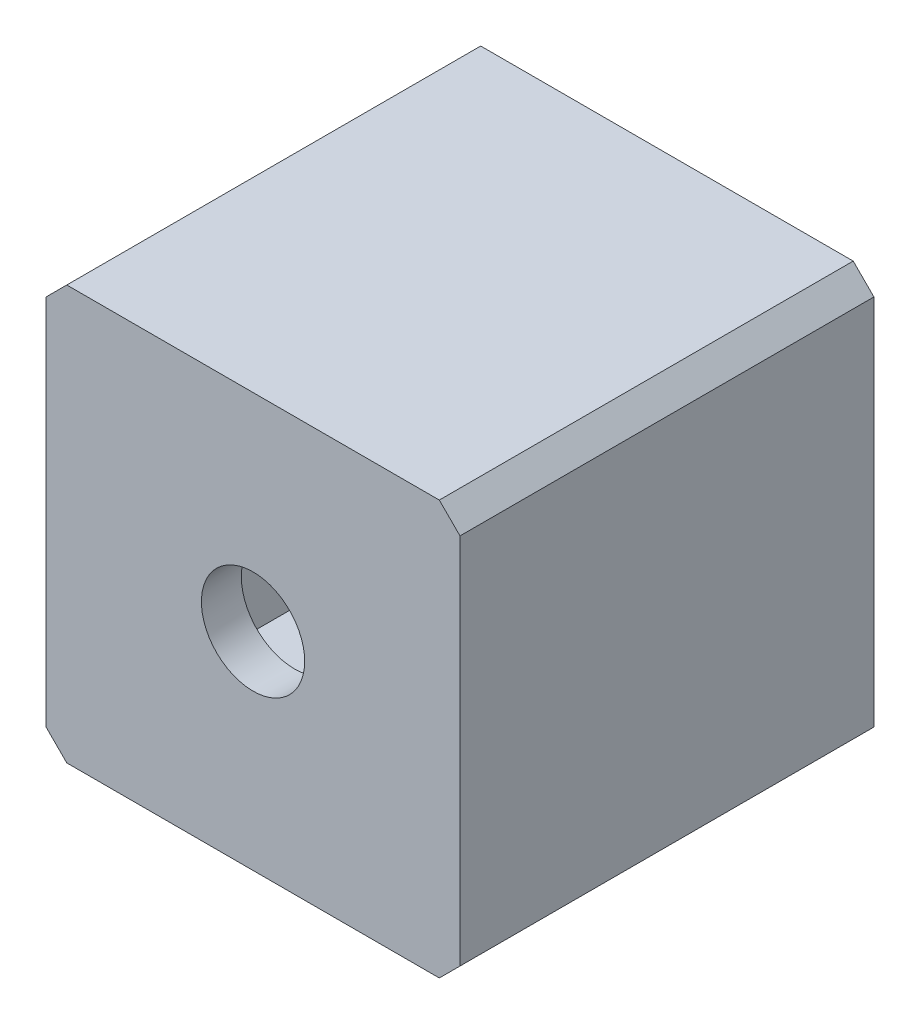
ISO-10303-21;
HEADER;
FILE_DESCRIPTION(('STEP AP214'),'2;1');
FILE_NAME('part.step','',(''),(''),'','','');
FILE_SCHEMA(('AUTOMOTIVE_DESIGN { 1 0 10303 214 1 1 1 1 }'));
ENDSEC;
DATA;
#1=APPLICATION_CONTEXT('core data for automotive mechanical design processes');
#2=APPLICATION_PROTOCOL_DEFINITION('international standard','automotive_design',2000,#1);
#3=PRODUCT_CONTEXT('',#1,'mechanical');
#4=PRODUCT('Part','Part','',(#3));
#5=PRODUCT_RELATED_PRODUCT_CATEGORY('part','',(#4));
#6=PRODUCT_DEFINITION_FORMATION('','',#4);
#7=PRODUCT_DEFINITION_CONTEXT('part definition',#1,'design');
#8=PRODUCT_DEFINITION('design','',#6,#7);
#9=PRODUCT_DEFINITION_SHAPE('','',#8);
#10=(LENGTH_UNIT() NAMED_UNIT(*) SI_UNIT(.MILLI.,.METRE.));
#11=(NAMED_UNIT(*) PLANE_ANGLE_UNIT() SI_UNIT($,.RADIAN.));
#12=(NAMED_UNIT(*) SI_UNIT($,.STERADIAN.) SOLID_ANGLE_UNIT());
#13=UNCERTAINTY_MEASURE_WITH_UNIT(LENGTH_MEASURE(1.E-05),#10,'distance_accuracy_value','');
#14=(GEOMETRIC_REPRESENTATION_CONTEXT(3) GLOBAL_UNCERTAINTY_ASSIGNED_CONTEXT((#13)) GLOBAL_UNIT_ASSIGNED_CONTEXT((#10,
#11,#12)) REPRESENTATION_CONTEXT('',''));
#15=CARTESIAN_POINT('',(0.,0.,0.));
#16=DIRECTION('',(0.,0.,1.));
#17=DIRECTION('',(1.,0.,0.));
#18=AXIS2_PLACEMENT_3D('',#15,#16,#17);
#19=CARTESIAN_POINT('',(-24.6304102547524,19.1826555023924,17.));
#20=DIRECTION('',(0.,0.,-1.));
#21=DIRECTION('',(1.,0.,0.));
#22=AXIS2_PLACEMENT_3D('',#19,#20,#21);
#23=CONICAL_SURFACE('',#22,2.6,0.0349065850398866);
#24=CARTESIAN_POINT('',(-24.6304102547524,19.1826555023924,20.));
#25=DIRECTION('',(0.,0.,1.));
#26=DIRECTION('',(1.,0.,0.));
#27=AXIS2_PLACEMENT_3D('',#24,#25,#26);
#28=CIRCLE('',#27,2.49523769152476);
#29=CARTESIAN_POINT('',(-22.1351725632276,19.1826555023924,20.));
#30=VERTEX_POINT('',#29);
#31=EDGE_CURVE('E170',#30,#30,#28,.T.);
#32=ORIENTED_EDGE('',*,*,#31,.T.);
#33=EDGE_LOOP('',(#32));
#34=FACE_BOUND('',#33,.T.);
#35=CARTESIAN_POINT('',(-24.6304102547524,19.1826555023924,18.));
#36=DIRECTION('',(0.,0.,-1.));
#37=DIRECTION('',(-1.,0.,0.));
#38=AXIS2_PLACEMENT_3D('',#35,#36,#37);
#39=CIRCLE('',#38,2.56507923050825);
#40=CARTESIAN_POINT('',(-27.1954894852606,19.1826555023924,18.));
#41=VERTEX_POINT('',#40);
#42=EDGE_CURVE('E166',#41,#41,#39,.T.);
#43=ORIENTED_EDGE('',*,*,#42,.T.);
#44=EDGE_LOOP('',(#43));
#45=FACE_BOUND('',#44,.T.);
#46=ADVANCED_FACE('F35',(#34,#45),#23,.F.);
#47=CARTESIAN_POINT('',(-34.6304102547524,29.1826555023924,20.));
#48=DIRECTION('',(1.,0.,0.));
#49=DIRECTION('',(0.,1.,0.));
#50=AXIS2_PLACEMENT_3D('',#47,#48,#49);
#51=PLANE('',#50);
#52=DIRECTION('',(0.,-1.,0.));
#53=VECTOR('',#52,1.);
#54=CARTESIAN_POINT('',(-34.6304102547524,29.1826555023924,20.));
#55=LINE('',#54,#53);
#56=CARTESIAN_POINT('',(-34.6304102547524,28.1826555023924,20.));
#57=VERTEX_POINT('',#56);
#58=CARTESIAN_POINT('',(-34.6304102547524,10.1826555023923,20.));
#59=VERTEX_POINT('',#58);
#60=EDGE_CURVE('E174',#57,#59,#55,.T.);
#61=ORIENTED_EDGE('',*,*,#60,.F.);
#62=DIRECTION('',(0.,0.,-1.));
#63=VECTOR('',#62,1.);
#64=CARTESIAN_POINT('',(-34.6304102547524,28.1826555023924,20.));
#65=LINE('',#64,#63);
#66=CARTESIAN_POINT('',(-34.6304102547524,28.1826555023924,0.));
#67=VERTEX_POINT('',#66);
#68=EDGE_CURVE('E11',#57,#67,#65,.T.);
#69=ORIENTED_EDGE('',*,*,#68,.T.);
#70=DIRECTION('',(0.,-1.,0.));
#71=VECTOR('',#70,1.);
#72=CARTESIAN_POINT('',(-34.6304102547524,29.1826555023924,0.));
#73=LINE('',#72,#71);
#74=CARTESIAN_POINT('',(-34.6304102547524,10.1826555023923,0.));
#75=VERTEX_POINT('',#74);
#76=EDGE_CURVE('E173',#67,#75,#73,.T.);
#77=ORIENTED_EDGE('',*,*,#76,.T.);
#78=DIRECTION('',(0.,0.,1.));
#79=VECTOR('',#78,1.);
#80=CARTESIAN_POINT('',(-34.6304102547524,10.1826555023923,20.));
#81=LINE('',#80,#79);
#82=EDGE_CURVE('E44',#75,#59,#81,.T.);
#83=ORIENTED_EDGE('',*,*,#82,.T.);
#84=EDGE_LOOP('',(#61,#69,#77,#83));
#85=FACE_BOUND('',#84,.T.);
#86=ADVANCED_FACE('F227',(#85),#51,.F.);
#87=CARTESIAN_POINT('',(-34.6304102547524,9.18265550239235,20.));
#88=DIRECTION('',(0.,1.,0.));
#89=DIRECTION('',(-1.,0.,0.));
#90=AXIS2_PLACEMENT_3D('',#87,#88,#89);
#91=PLANE('',#90);
#92=DIRECTION('',(1.,0.,0.));
#93=VECTOR('',#92,1.);
#94=CARTESIAN_POINT('',(-34.6304102547524,9.18265550239235,0.));
#95=LINE('',#94,#93);
#96=CARTESIAN_POINT('',(-33.6304102547524,9.18265550239235,0.));
#97=VERTEX_POINT('',#96);
#98=CARTESIAN_POINT('',(-15.6304102547524,9.18265550239235,0.));
#99=VERTEX_POINT('',#98);
#100=EDGE_CURVE('E188',#97,#99,#95,.T.);
#101=ORIENTED_EDGE('',*,*,#100,.T.);
#102=DIRECTION('',(0.,0.,1.));
#103=VECTOR('',#102,1.);
#104=CARTESIAN_POINT('',(-15.6304102547524,9.18265550239235,20.));
#105=LINE('',#104,#103);
#106=CARTESIAN_POINT('',(-15.6304102547524,9.18265550239235,20.));
#107=VERTEX_POINT('',#106);
#108=EDGE_CURVE('E212',#99,#107,#105,.T.);
#109=ORIENTED_EDGE('',*,*,#108,.T.);
#110=DIRECTION('',(1.,0.,0.));
#111=VECTOR('',#110,1.);
#112=CARTESIAN_POINT('',(-34.6304102547524,9.18265550239235,20.));
#113=LINE('',#112,#111);
#114=CARTESIAN_POINT('',(-33.6304102547524,9.18265550239235,20.));
#115=VERTEX_POINT('',#114);
#116=EDGE_CURVE('E177',#115,#107,#113,.T.);
#117=ORIENTED_EDGE('',*,*,#116,.F.);
#118=DIRECTION('',(0.,0.,-1.));
#119=VECTOR('',#118,1.);
#120=CARTESIAN_POINT('',(-33.6304102547524,9.18265550239235,20.));
#121=LINE('',#120,#119);
#122=EDGE_CURVE('E209',#115,#97,#121,.T.);
#123=ORIENTED_EDGE('',*,*,#122,.T.);
#124=EDGE_LOOP('',(#101,#109,#117,#123));
#125=FACE_BOUND('',#124,.T.);
#126=ADVANCED_FACE('F238',(#125),#91,.F.);
#127=CARTESIAN_POINT('',(-14.6304102547524,29.1826555023924,20.));
#128=DIRECTION('',(-1.,0.,0.));
#129=DIRECTION('',(0.,-1.,0.));
#130=AXIS2_PLACEMENT_3D('',#127,#128,#129);
#131=PLANE('',#130);
#132=DIRECTION('',(0.,1.,0.));
#133=VECTOR('',#132,1.);
#134=CARTESIAN_POINT('',(-14.6304102547524,29.1826555023924,20.));
#135=LINE('',#134,#133);
#136=CARTESIAN_POINT('',(-14.6304102547524,10.1826555023924,20.));
#137=VERTEX_POINT('',#136);
#138=CARTESIAN_POINT('',(-14.6304102547524,28.1826555023923,20.));
#139=VERTEX_POINT('',#138);
#140=EDGE_CURVE('E181',#137,#139,#135,.T.);
#141=ORIENTED_EDGE('',*,*,#140,.F.);
#142=DIRECTION('',(0.,0.,-1.));
#143=VECTOR('',#142,1.);
#144=CARTESIAN_POINT('',(-14.6304102547524,10.1826555023924,20.));
#145=LINE('',#144,#143);
#146=CARTESIAN_POINT('',(-14.6304102547524,10.1826555023924,0.));
#147=VERTEX_POINT('',#146);
#148=EDGE_CURVE('E198',#137,#147,#145,.T.);
#149=ORIENTED_EDGE('',*,*,#148,.T.);
#150=DIRECTION('',(0.,1.,0.));
#151=VECTOR('',#150,1.);
#152=CARTESIAN_POINT('',(-14.6304102547524,29.1826555023924,0.));
#153=LINE('',#152,#151);
#154=CARTESIAN_POINT('',(-14.6304102547524,28.1826555023923,0.));
#155=VERTEX_POINT('',#154);
#156=EDGE_CURVE('E191',#147,#155,#153,.T.);
#157=ORIENTED_EDGE('',*,*,#156,.T.);
#158=DIRECTION('',(0.,0.,1.));
#159=VECTOR('',#158,1.);
#160=CARTESIAN_POINT('',(-14.6304102547524,28.1826555023923,20.));
#161=LINE('',#160,#159);
#162=EDGE_CURVE('E185',#155,#139,#161,.T.);
#163=ORIENTED_EDGE('',*,*,#162,.T.);
#164=EDGE_LOOP('',(#141,#149,#157,#163));
#165=FACE_BOUND('',#164,.T.);
#166=ADVANCED_FACE('F249',(#165),#131,.F.);
#167=CARTESIAN_POINT('',(-34.6304102547524,29.1826555023924,20.));
#168=DIRECTION('',(0.,-1.,0.));
#169=DIRECTION('',(0.,0.,-1.));
#170=AXIS2_PLACEMENT_3D('',#167,#168,#169);
#171=PLANE('',#170);
#172=DIRECTION('',(-1.,0.,0.));
#173=VECTOR('',#172,1.);
#174=CARTESIAN_POINT('',(-34.6304102547524,29.1826555023924,20.));
#175=LINE('',#174,#173);
#176=CARTESIAN_POINT('',(-15.6304102547524,29.1826555023924,20.));
#177=VERTEX_POINT('',#176);
#178=CARTESIAN_POINT('',(-33.6304102547524,29.1826555023924,20.));
#179=VERTEX_POINT('',#178);
#180=EDGE_CURVE('E183',#177,#179,#175,.T.);
#181=ORIENTED_EDGE('',*,*,#180,.F.);
#182=DIRECTION('',(0.,0.,-1.));
#183=VECTOR('',#182,1.);
#184=CARTESIAN_POINT('',(-15.6304102547524,29.1826555023924,20.));
#185=LINE('',#184,#183);
#186=CARTESIAN_POINT('',(-15.6304102547524,29.1826555023924,0.));
#187=VERTEX_POINT('',#186);
#188=EDGE_CURVE('E222',#177,#187,#185,.T.);
#189=ORIENTED_EDGE('',*,*,#188,.T.);
#190=DIRECTION('',(-1.,0.,0.));
#191=VECTOR('',#190,1.);
#192=CARTESIAN_POINT('',(-34.6304102547524,29.1826555023924,0.));
#193=LINE('',#192,#191);
#194=CARTESIAN_POINT('',(-33.6304102547524,29.1826555023924,0.));
#195=VERTEX_POINT('',#194);
#196=EDGE_CURVE('E178',#187,#195,#193,.T.);
#197=ORIENTED_EDGE('',*,*,#196,.T.);
#198=DIRECTION('',(0.,0.,1.));
#199=VECTOR('',#198,1.);
#200=CARTESIAN_POINT('',(-33.6304102547524,29.1826555023924,20.));
#201=LINE('',#200,#199);
#202=EDGE_CURVE('E51',#195,#179,#201,.T.);
#203=ORIENTED_EDGE('',*,*,#202,.T.);
#204=EDGE_LOOP('',(#181,#189,#197,#203));
#205=FACE_BOUND('',#204,.T.);
#206=ADVANCED_FACE('F255',(#205),#171,.F.);
#207=CARTESIAN_POINT('',(0.,0.,20.));
#208=DIRECTION('',(0.,0.,1.));
#209=DIRECTION('',(1.,0.,0.));
#210=AXIS2_PLACEMENT_3D('',#207,#208,#209);
#211=PLANE('',#210);
#212=ORIENTED_EDGE('',*,*,#31,.F.);
#213=EDGE_LOOP('',(#212));
#214=FACE_BOUND('',#213,.T.);
#215=ORIENTED_EDGE('',*,*,#116,.T.);
#216=DIRECTION('',(-0.707106781186549,-0.707106781186546,0.));
#217=VECTOR('',#216,1.);
#218=CARTESIAN_POINT('',(-12.4065328785723,12.4065328785724,20.));
#219=LINE('',#218,#217);
#220=EDGE_CURVE('E219',#107,#137,#219,.F.);
#221=ORIENTED_EDGE('',*,*,#220,.T.);
#222=ORIENTED_EDGE('',*,*,#140,.T.);
#223=DIRECTION('',(0.707106781186546,-0.707106781186549,0.));
#224=VECTOR('',#223,1.);
#225=CARTESIAN_POINT('',(6.77612262381995,6.77612262381993,20.));
#226=LINE('',#225,#224);
#227=EDGE_CURVE('E58',#139,#177,#226,.F.);
#228=ORIENTED_EDGE('',*,*,#227,.T.);
#229=ORIENTED_EDGE('',*,*,#180,.T.);
#230=DIRECTION('',(0.707106781186549,0.707106781186546,0.));
#231=VECTOR('',#230,1.);
#232=CARTESIAN_POINT('',(-31.4065328785723,31.4065328785724,20.));
#233=LINE('',#232,#231);
#234=EDGE_CURVE('E216',#179,#57,#233,.F.);
#235=ORIENTED_EDGE('',*,*,#234,.T.);
#236=ORIENTED_EDGE('',*,*,#60,.T.);
#237=DIRECTION('',(-0.707106781186548,0.707106781186548,0.));
#238=VECTOR('',#237,1.);
#239=CARTESIAN_POINT('',(-12.22387737618,-12.22387737618,20.));
#240=LINE('',#239,#238);
#241=EDGE_CURVE('E214',#59,#115,#240,.F.);
#242=ORIENTED_EDGE('',*,*,#241,.T.);
#243=EDGE_LOOP('',(#215,#221,#222,#228,#229,#235,#236,#242));
#244=FACE_BOUND('',#243,.T.);
#245=ADVANCED_FACE('F232',(#214,#244),#211,.T.);
#246=CARTESIAN_POINT('',(0.,0.,0.));
#247=DIRECTION('',(0.,0.,1.));
#248=DIRECTION('',(1.,0.,0.));
#249=AXIS2_PLACEMENT_3D('',#246,#247,#248);
#250=PLANE('',#249);
#251=DIRECTION('',(-1.,0.,0.));
#252=VECTOR('',#251,1.);
#253=CARTESIAN_POINT('',(-16.6304102547524,11.1826555023924,0.));
#254=LINE('',#253,#252);
#255=CARTESIAN_POINT('',(-16.6304102547524,11.1826555023924,0.));
#256=VERTEX_POINT('',#255);
#257=CARTESIAN_POINT('',(-32.6304102547524,11.1826555023923,0.));
#258=VERTEX_POINT('',#257);
#259=EDGE_CURVE('E160',#256,#258,#254,.T.);
#260=ORIENTED_EDGE('',*,*,#259,.F.);
#261=DIRECTION('',(0.,-1.,0.));
#262=VECTOR('',#261,1.);
#263=CARTESIAN_POINT('',(-16.6304102547524,27.1826555023924,0.));
#264=LINE('',#263,#262);
#265=CARTESIAN_POINT('',(-16.6304102547524,27.1826555023924,0.));
#266=VERTEX_POINT('',#265);
#267=EDGE_CURVE('E134',#266,#256,#264,.T.);
#268=ORIENTED_EDGE('',*,*,#267,.F.);
#269=DIRECTION('',(1.,0.,0.));
#270=VECTOR('',#269,1.);
#271=CARTESIAN_POINT('',(-16.6304102547524,27.1826555023924,0.));
#272=LINE('',#271,#270);
#273=CARTESIAN_POINT('',(-32.6304102547524,27.1826555023924,0.));
#274=VERTEX_POINT('',#273);
#275=EDGE_CURVE('E151',#274,#266,#272,.T.);
#276=ORIENTED_EDGE('',*,*,#275,.F.);
#277=DIRECTION('',(0.,1.,0.));
#278=VECTOR('',#277,1.);
#279=CARTESIAN_POINT('',(-32.6304102547524,27.1826555023924,0.));
#280=LINE('',#279,#278);
#281=EDGE_CURVE('E154',#258,#274,#280,.T.);
#282=ORIENTED_EDGE('',*,*,#281,.F.);
#283=EDGE_LOOP('',(#260,#268,#276,#282));
#284=FACE_BOUND('',#283,.T.);
#285=ORIENTED_EDGE('',*,*,#156,.F.);
#286=DIRECTION('',(0.707106781186549,0.707106781186546,0.));
#287=VECTOR('',#286,1.);
#288=CARTESIAN_POINT('',(-14.6304102547524,10.1826555023924,0.));
#289=LINE('',#288,#287);
#290=EDGE_CURVE('E207',#147,#99,#289,.F.);
#291=ORIENTED_EDGE('',*,*,#290,.T.);
#292=ORIENTED_EDGE('',*,*,#100,.F.);
#293=DIRECTION('',(0.707106781186548,-0.707106781186548,0.));
#294=VECTOR('',#293,1.);
#295=CARTESIAN_POINT('',(-33.6304102547524,9.18265550239235,0.));
#296=LINE('',#295,#294);
#297=EDGE_CURVE('E201',#97,#75,#296,.F.);
#298=ORIENTED_EDGE('',*,*,#297,.T.);
#299=ORIENTED_EDGE('',*,*,#76,.F.);
#300=DIRECTION('',(-0.707106781186549,-0.707106781186546,0.));
#301=VECTOR('',#300,1.);
#302=CARTESIAN_POINT('',(-34.6304102547524,28.1826555023924,0.));
#303=LINE('',#302,#301);
#304=EDGE_CURVE('E203',#67,#195,#303,.F.);
#305=ORIENTED_EDGE('',*,*,#304,.T.);
#306=ORIENTED_EDGE('',*,*,#196,.F.);
#307=DIRECTION('',(-0.707106781186546,0.707106781186549,0.));
#308=VECTOR('',#307,1.);
#309=CARTESIAN_POINT('',(-15.6304102547524,29.1826555023924,0.));
#310=LINE('',#309,#308);
#311=EDGE_CURVE('E205',#187,#155,#310,.F.);
#312=ORIENTED_EDGE('',*,*,#311,.T.);
#313=EDGE_LOOP('',(#285,#291,#292,#298,#299,#305,#306,#312));
#314=FACE_BOUND('',#313,.T.);
#315=ADVANCED_FACE('F242',(#284,#314),#250,.F.);
#316=CARTESIAN_POINT('',(-16.6304102547524,27.1826555023924,18.));
#317=DIRECTION('',(1.,0.,0.));
#318=DIRECTION('',(0.,0.,-1.));
#319=AXIS2_PLACEMENT_3D('',#316,#317,#318);
#320=PLANE('',#319);
#321=ORIENTED_EDGE('',*,*,#267,.T.);
#322=DIRECTION('',(0.,0.,-1.));
#323=VECTOR('',#322,1.);
#324=CARTESIAN_POINT('',(-16.6304102547524,11.1826555023924,18.));
#325=LINE('',#324,#323);
#326=CARTESIAN_POINT('',(-16.6304102547524,11.1826555023924,18.));
#327=VERTEX_POINT('',#326);
#328=EDGE_CURVE('E127',#327,#256,#325,.T.);
#329=ORIENTED_EDGE('',*,*,#328,.F.);
#330=DIRECTION('',(0.,-1.,0.));
#331=VECTOR('',#330,1.);
#332=CARTESIAN_POINT('',(-16.6304102547524,27.1826555023924,18.));
#333=LINE('',#332,#331);
#334=CARTESIAN_POINT('',(-16.6304102547524,27.1826555023924,18.));
#335=VERTEX_POINT('',#334);
#336=EDGE_CURVE('E131',#335,#327,#333,.T.);
#337=ORIENTED_EDGE('',*,*,#336,.F.);
#338=DIRECTION('',(0.,0.,-1.));
#339=VECTOR('',#338,1.);
#340=CARTESIAN_POINT('',(-16.6304102547524,27.1826555023924,18.));
#341=LINE('',#340,#339);
#342=EDGE_CURVE('E164',#335,#266,#341,.T.);
#343=ORIENTED_EDGE('',*,*,#342,.T.);
#344=EDGE_LOOP('',(#321,#329,#337,#343));
#345=FACE_BOUND('',#344,.T.);
#346=ADVANCED_FACE('F129',(#345),#320,.F.);
#347=CARTESIAN_POINT('',(-16.6304102547524,27.1826555023924,18.));
#348=DIRECTION('',(0.,1.,0.));
#349=DIRECTION('',(0.,0.,1.));
#350=AXIS2_PLACEMENT_3D('',#347,#348,#349);
#351=PLANE('',#350);
#352=ORIENTED_EDGE('',*,*,#275,.T.);
#353=ORIENTED_EDGE('',*,*,#342,.F.);
#354=DIRECTION('',(1.,0.,0.));
#355=VECTOR('',#354,1.);
#356=CARTESIAN_POINT('',(-16.6304102547524,27.1826555023924,18.));
#357=LINE('',#356,#355);
#358=CARTESIAN_POINT('',(-32.6304102547524,27.1826555023924,18.));
#359=VERTEX_POINT('',#358);
#360=EDGE_CURVE('E139',#359,#335,#357,.T.);
#361=ORIENTED_EDGE('',*,*,#360,.F.);
#362=DIRECTION('',(0.,0.,-1.));
#363=VECTOR('',#362,1.);
#364=CARTESIAN_POINT('',(-32.6304102547524,27.1826555023924,18.));
#365=LINE('',#364,#363);
#366=EDGE_CURVE('E167',#359,#274,#365,.T.);
#367=ORIENTED_EDGE('',*,*,#366,.T.);
#368=EDGE_LOOP('',(#352,#353,#361,#367));
#369=FACE_BOUND('',#368,.T.);
#370=ADVANCED_FACE('F310',(#369),#351,.F.);
#371=CARTESIAN_POINT('',(-32.6304102547524,27.1826555023924,18.));
#372=DIRECTION('',(-1.,0.,0.));
#373=DIRECTION('',(0.,-1.,0.));
#374=AXIS2_PLACEMENT_3D('',#371,#372,#373);
#375=PLANE('',#374);
#376=ORIENTED_EDGE('',*,*,#281,.T.);
#377=ORIENTED_EDGE('',*,*,#366,.F.);
#378=DIRECTION('',(0.,1.,0.));
#379=VECTOR('',#378,1.);
#380=CARTESIAN_POINT('',(-32.6304102547524,27.1826555023924,18.));
#381=LINE('',#380,#379);
#382=CARTESIAN_POINT('',(-32.6304102547524,11.1826555023923,18.));
#383=VERTEX_POINT('',#382);
#384=EDGE_CURVE('E147',#383,#359,#381,.T.);
#385=ORIENTED_EDGE('',*,*,#384,.F.);
#386=DIRECTION('',(0.,0.,-1.));
#387=VECTOR('',#386,1.);
#388=CARTESIAN_POINT('',(-32.6304102547524,11.1826555023923,18.));
#389=LINE('',#388,#387);
#390=EDGE_CURVE('E138',#383,#258,#389,.T.);
#391=ORIENTED_EDGE('',*,*,#390,.T.);
#392=EDGE_LOOP('',(#376,#377,#385,#391));
#393=FACE_BOUND('',#392,.T.);
#394=ADVANCED_FACE('F307',(#393),#375,.F.);
#395=CARTESIAN_POINT('',(-16.6304102547524,11.1826555023924,18.));
#396=DIRECTION('',(0.,-1.,0.));
#397=DIRECTION('',(1.,0.,0.));
#398=AXIS2_PLACEMENT_3D('',#395,#396,#397);
#399=PLANE('',#398);
#400=ORIENTED_EDGE('',*,*,#259,.T.);
#401=ORIENTED_EDGE('',*,*,#390,.F.);
#402=DIRECTION('',(-1.,0.,0.));
#403=VECTOR('',#402,1.);
#404=CARTESIAN_POINT('',(-16.6304102547524,11.1826555023924,18.));
#405=LINE('',#404,#403);
#406=EDGE_CURVE('E142',#327,#383,#405,.T.);
#407=ORIENTED_EDGE('',*,*,#406,.F.);
#408=ORIENTED_EDGE('',*,*,#328,.T.);
#409=EDGE_LOOP('',(#400,#401,#407,#408));
#410=FACE_BOUND('',#409,.T.);
#411=ADVANCED_FACE('F143',(#410),#399,.F.);
#412=CARTESIAN_POINT('',(0.,0.,18.));
#413=DIRECTION('',(0.,0.,-1.));
#414=DIRECTION('',(-1.,0.,0.));
#415=AXIS2_PLACEMENT_3D('',#412,#413,#414);
#416=PLANE('',#415);
#417=ORIENTED_EDGE('',*,*,#42,.F.);
#418=EDGE_LOOP('',(#417));
#419=FACE_BOUND('',#418,.T.);
#420=ORIENTED_EDGE('',*,*,#336,.T.);
#421=ORIENTED_EDGE('',*,*,#406,.T.);
#422=ORIENTED_EDGE('',*,*,#384,.T.);
#423=ORIENTED_EDGE('',*,*,#360,.T.);
#424=EDGE_LOOP('',(#420,#421,#422,#423));
#425=FACE_BOUND('',#424,.T.);
#426=ADVANCED_FACE('F149',(#419,#425),#416,.T.);
#427=CARTESIAN_POINT('',(-14.6304102547524,10.1826555023924,20.));
#428=DIRECTION('',(-0.707106781186546,0.707106781186549,0.));
#429=DIRECTION('',(0.,0.,-1.));
#430=AXIS2_PLACEMENT_3D('',#427,#428,#429);
#431=PLANE('',#430);
#432=ORIENTED_EDGE('',*,*,#220,.F.);
#433=ORIENTED_EDGE('',*,*,#108,.F.);
#434=ORIENTED_EDGE('',*,*,#290,.F.);
#435=ORIENTED_EDGE('',*,*,#148,.F.);
#436=EDGE_LOOP('',(#432,#433,#434,#435));
#437=FACE_BOUND('',#436,.T.);
#438=ADVANCED_FACE('F246',(#437),#431,.F.);
#439=CARTESIAN_POINT('',(-15.6304102547524,29.1826555023924,20.));
#440=DIRECTION('',(-0.707106781186549,-0.707106781186546,0.));
#441=DIRECTION('',(0.,0.,-1.));
#442=AXIS2_PLACEMENT_3D('',#439,#440,#441);
#443=PLANE('',#442);
#444=ORIENTED_EDGE('',*,*,#227,.F.);
#445=ORIENTED_EDGE('',*,*,#162,.F.);
#446=ORIENTED_EDGE('',*,*,#311,.F.);
#447=ORIENTED_EDGE('',*,*,#188,.F.);
#448=EDGE_LOOP('',(#444,#445,#446,#447));
#449=FACE_BOUND('',#448,.T.);
#450=ADVANCED_FACE('F253',(#449),#443,.F.);
#451=CARTESIAN_POINT('',(-34.6304102547524,28.1826555023924,20.));
#452=DIRECTION('',(0.707106781186546,-0.707106781186549,0.));
#453=DIRECTION('',(0.,0.,-1.));
#454=AXIS2_PLACEMENT_3D('',#451,#452,#453);
#455=PLANE('',#454);
#456=ORIENTED_EDGE('',*,*,#234,.F.);
#457=ORIENTED_EDGE('',*,*,#202,.F.);
#458=ORIENTED_EDGE('',*,*,#304,.F.);
#459=ORIENTED_EDGE('',*,*,#68,.F.);
#460=EDGE_LOOP('',(#456,#457,#458,#459));
#461=FACE_BOUND('',#460,.T.);
#462=ADVANCED_FACE('F257',(#461),#455,.F.);
#463=CARTESIAN_POINT('',(-33.6304102547524,9.18265550239235,20.));
#464=DIRECTION('',(0.707106781186547,0.707106781186547,0.));
#465=DIRECTION('',(0.,0.,-1.));
#466=AXIS2_PLACEMENT_3D('',#463,#464,#465);
#467=PLANE('',#466);
#468=ORIENTED_EDGE('',*,*,#241,.F.);
#469=ORIENTED_EDGE('',*,*,#82,.F.);
#470=ORIENTED_EDGE('',*,*,#297,.F.);
#471=ORIENTED_EDGE('',*,*,#122,.F.);
#472=EDGE_LOOP('',(#468,#469,#470,#471));
#473=FACE_BOUND('',#472,.T.);
#474=ADVANCED_FACE('F38',(#473),#467,.F.);
#475=CLOSED_SHELL('',(#46,#86,#126,#166,#206,#245,#315,#346,#370,#394,#411,#426,#438,#450,#462,#474));
#476=MANIFOLD_SOLID_BREP('B2',#475);
#477=ADVANCED_BREP_SHAPE_REPRESENTATION('',(#18,#476),#14);
#478=SHAPE_DEFINITION_REPRESENTATION(#9,#477);
ENDSEC;
END-ISO-10303-21;
